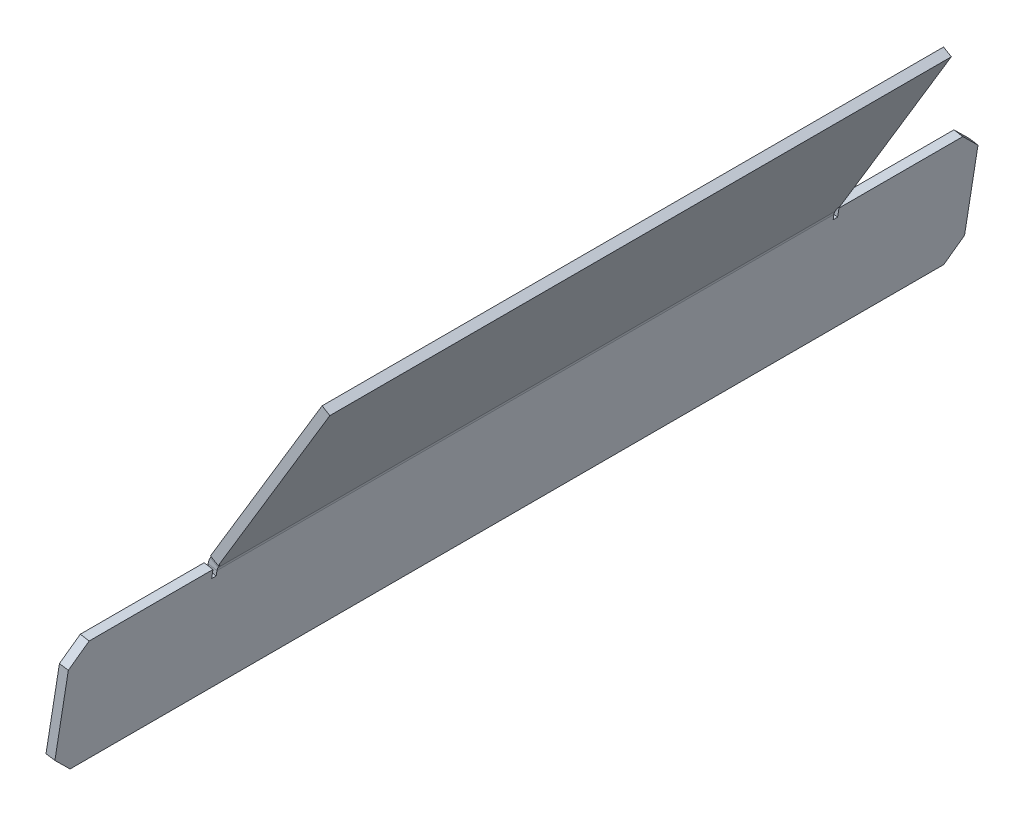
ISO-10303-21;
HEADER;
FILE_DESCRIPTION(('STEP AP214'),'2;1');
FILE_NAME('part.step','',(''),(''),'','','');
FILE_SCHEMA(('AUTOMOTIVE_DESIGN { 1 0 10303 214 1 1 1 1 }'));
ENDSEC;
DATA;
#1=APPLICATION_CONTEXT('core data for automotive mechanical design processes');
#2=APPLICATION_PROTOCOL_DEFINITION('international standard','automotive_design',2000,#1);
#3=PRODUCT_CONTEXT('',#1,'mechanical');
#4=PRODUCT('Part','Part','',(#3));
#5=PRODUCT_RELATED_PRODUCT_CATEGORY('part','',(#4));
#6=PRODUCT_DEFINITION_FORMATION('','',#4);
#7=PRODUCT_DEFINITION_CONTEXT('part definition',#1,'design');
#8=PRODUCT_DEFINITION('design','',#6,#7);
#9=PRODUCT_DEFINITION_SHAPE('','',#8);
#10=(LENGTH_UNIT() NAMED_UNIT(*) SI_UNIT(.MILLI.,.METRE.));
#11=(NAMED_UNIT(*) PLANE_ANGLE_UNIT() SI_UNIT($,.RADIAN.));
#12=(NAMED_UNIT(*) SI_UNIT($,.STERADIAN.) SOLID_ANGLE_UNIT());
#13=UNCERTAINTY_MEASURE_WITH_UNIT(LENGTH_MEASURE(1.E-05),#10,'distance_accuracy_value','');
#14=(GEOMETRIC_REPRESENTATION_CONTEXT(3) GLOBAL_UNCERTAINTY_ASSIGNED_CONTEXT((#13)) GLOBAL_UNIT_ASSIGNED_CONTEXT((#10,
#11,#12)) REPRESENTATION_CONTEXT('',''));
#15=CARTESIAN_POINT('',(0.,0.,0.));
#16=DIRECTION('',(0.,0.,1.));
#17=DIRECTION('',(1.,0.,0.));
#18=AXIS2_PLACEMENT_3D('',#15,#16,#17);
#19=CARTESIAN_POINT('',(643.884672042635,752.187115289054,108.74375));
#20=DIRECTION('',(0.,0.,-1.));
#21=DIRECTION('',(-0.515038074910061,-0.857167300702109,0.));
#22=AXIS2_PLACEMENT_3D('',#19,#20,#21);
#23=PLANE('',#22);
#24=DIRECTION('',(-0.857167300702108,0.515038074910061,0.));
#25=VECTOR('',#24,1.);
#26=CARTESIAN_POINT('',(644.520391245024,753.245129714126,108.74375));
#27=LINE('',#26,#25);
#28=CARTESIAN_POINT('',(647.241897424753,751.609883826287,108.74375));
#29=VERTEX_POINT('',#28);
#30=CARTESIAN_POINT('',(644.520391245024,753.245129714126,108.74375));
#31=VERTEX_POINT('',#30);
#32=EDGE_CURVE('E11',#29,#31,#27,.T.);
#33=ORIENTED_EDGE('',*,*,#32,.F.);
#34=DIRECTION('',(-0.515038074910061,-0.857167300702109,0.));
#35=VECTOR('',#34,1.);
#36=CARTESIAN_POINT('',(646.606178222364,750.551869401215,108.74375));
#37=LINE('',#36,#35);
#38=CARTESIAN_POINT('',(648.059520368673,752.970636916151,108.74375));
#39=VERTEX_POINT('',#38);
#40=EDGE_CURVE('E219',#39,#29,#37,.T.);
#41=ORIENTED_EDGE('',*,*,#40,.F.);
#42=DIRECTION('',(-0.857167300702108,0.515038074910061,0.));
#43=VECTOR('',#42,1.);
#44=CARTESIAN_POINT('',(645.338014188943,754.605882803991,108.74375));
#45=LINE('',#44,#43);
#46=CARTESIAN_POINT('',(645.338014188943,754.605882803991,108.74375));
#47=VERTEX_POINT('',#46);
#48=EDGE_CURVE('E49',#39,#47,#45,.T.);
#49=ORIENTED_EDGE('',*,*,#48,.T.);
#50=DIRECTION('',(-0.515038074910061,-0.857167300702109,0.));
#51=VECTOR('',#50,1.);
#52=CARTESIAN_POINT('',(643.884672042635,752.187115289054,108.74375));
#53=LINE('',#52,#51);
#54=EDGE_CURVE('E298',#47,#31,#53,.T.);
#55=ORIENTED_EDGE('',*,*,#54,.T.);
#56=EDGE_LOOP('',(#33,#41,#49,#55));
#57=FACE_BOUND('',#56,.T.);
#58=ADVANCED_FACE('F39',(#57),#23,.F.);
#59=CARTESIAN_POINT('',(645.338014188943,754.605882803991,-109.5375));
#60=DIRECTION('',(0.515038074910061,0.857167300702109,0.));
#61=DIRECTION('',(0.,0.,-1.));
#62=AXIS2_PLACEMENT_3D('',#59,#60,#61);
#63=PLANE('',#62);
#64=ORIENTED_EDGE('',*,*,#48,.F.);
#65=DIRECTION('',(0.,0.,1.));
#66=VECTOR('',#65,1.);
#67=CARTESIAN_POINT('',(648.059520368673,752.970636916151,-109.5375));
#68=LINE('',#67,#66);
#69=CARTESIAN_POINT('',(648.059520368673,752.970636916151,109.5375));
#70=VERTEX_POINT('',#69);
#71=EDGE_CURVE('E179',#70,#39,#68,.F.);
#72=ORIENTED_EDGE('',*,*,#71,.F.);
#73=DIRECTION('',(-0.857167300702108,0.515038074910061,0.));
#74=VECTOR('',#73,1.);
#75=CARTESIAN_POINT('',(645.338014188943,754.605882803991,109.5375));
#76=LINE('',#75,#74);
#77=CARTESIAN_POINT('',(645.338014188943,754.605882803991,109.5375));
#78=VERTEX_POINT('',#77);
#79=EDGE_CURVE('E292',#70,#78,#76,.T.);
#80=ORIENTED_EDGE('',*,*,#79,.T.);
#81=DIRECTION('',(0.,0.,-1.));
#82=VECTOR('',#81,1.);
#83=CARTESIAN_POINT('',(645.338014188943,754.605882803991,-109.5375));
#84=LINE('',#83,#82);
#85=EDGE_CURVE('E311',#78,#47,#84,.T.);
#86=ORIENTED_EDGE('',*,*,#85,.T.);
#87=EDGE_LOOP('',(#64,#72,#80,#86));
#88=FACE_BOUND('',#87,.T.);
#89=ADVANCED_FACE('F317',(#88),#63,.F.);
#90=CARTESIAN_POINT('',(643.884672042635,752.187115289054,109.5375));
#91=DIRECTION('',(0.,0.,-1.));
#92=DIRECTION('',(-0.515038074910061,-0.857167300702108,0.));
#93=AXIS2_PLACEMENT_3D('',#90,#91,#92);
#94=PLANE('',#93);
#95=ORIENTED_EDGE('',*,*,#79,.F.);
#96=DIRECTION('',(-0.515038074910061,-0.857167300702109,0.));
#97=VECTOR('',#96,1.);
#98=CARTESIAN_POINT('',(646.606178222364,750.551869401215,109.5375));
#99=LINE('',#98,#97);
#100=CARTESIAN_POINT('',(687.413907929238,818.46733667367,109.5375));
#101=VERTEX_POINT('',#100);
#102=EDGE_CURVE('E221',#101,#70,#99,.T.);
#103=ORIENTED_EDGE('',*,*,#102,.F.);
#104=DIRECTION('',(-0.857167300702108,0.515038074910061,0.));
#105=VECTOR('',#104,1.);
#106=CARTESIAN_POINT('',(684.692401749509,820.102582561509,109.5375));
#107=LINE('',#106,#105);
#108=CARTESIAN_POINT('',(684.692401749509,820.102582561509,109.5375));
#109=VERTEX_POINT('',#108);
#110=EDGE_CURVE('E289',#101,#109,#107,.T.);
#111=ORIENTED_EDGE('',*,*,#110,.T.);
#112=DIRECTION('',(-0.515038074910061,-0.857167300702108,0.));
#113=VECTOR('',#112,1.);
#114=CARTESIAN_POINT('',(643.884672042635,752.187115289054,109.5375));
#115=LINE('',#114,#113);
#116=EDGE_CURVE('E334',#109,#78,#115,.T.);
#117=ORIENTED_EDGE('',*,*,#116,.T.);
#118=EDGE_LOOP('',(#95,#103,#111,#117));
#119=FACE_BOUND('',#118,.T.);
#120=ADVANCED_FACE('F430',(#119),#94,.F.);
#121=CARTESIAN_POINT('',(684.692401749509,820.102582561509,-109.5375));
#122=DIRECTION('',(-0.515038074910061,-0.857167300702109,0.));
#123=DIRECTION('',(0.,0.,1.));
#124=AXIS2_PLACEMENT_3D('',#121,#122,#123);
#125=PLANE('',#124);
#126=ORIENTED_EDGE('',*,*,#110,.F.);
#127=DIRECTION('',(0.,0.,1.));
#128=VECTOR('',#127,1.);
#129=CARTESIAN_POINT('',(687.413907929238,818.46733667367,-109.5375));
#130=LINE('',#129,#128);
#131=CARTESIAN_POINT('',(687.413907929238,818.46733667367,-109.5375));
#132=VERTEX_POINT('',#131);
#133=EDGE_CURVE('E228',#132,#101,#130,.T.);
#134=ORIENTED_EDGE('',*,*,#133,.F.);
#135=DIRECTION('',(-0.857167300702108,0.515038074910061,0.));
#136=VECTOR('',#135,1.);
#137=CARTESIAN_POINT('',(684.692401749509,820.102582561509,-109.5375));
#138=LINE('',#137,#136);
#139=CARTESIAN_POINT('',(684.692401749509,820.102582561509,-109.5375));
#140=VERTEX_POINT('',#139);
#141=EDGE_CURVE('E286',#132,#140,#138,.T.);
#142=ORIENTED_EDGE('',*,*,#141,.T.);
#143=DIRECTION('',(0.,0.,1.));
#144=VECTOR('',#143,1.);
#145=CARTESIAN_POINT('',(684.692401749509,820.102582561509,-109.5375));
#146=LINE('',#145,#144);
#147=EDGE_CURVE('E337',#140,#109,#146,.T.);
#148=ORIENTED_EDGE('',*,*,#147,.T.);
#149=EDGE_LOOP('',(#126,#134,#142,#148));
#150=FACE_BOUND('',#149,.T.);
#151=ADVANCED_FACE('F435',(#150),#125,.F.);
#152=CARTESIAN_POINT('',(643.884672042635,752.187115289054,-109.5375));
#153=DIRECTION('',(0.,0.,-1.));
#154=DIRECTION('',(-0.515038074910061,-0.857167300702108,0.));
#155=AXIS2_PLACEMENT_3D('',#152,#153,#154);
#156=PLANE('',#155);
#157=ORIENTED_EDGE('',*,*,#141,.F.);
#158=DIRECTION('',(-0.515038074910061,-0.857167300702109,0.));
#159=VECTOR('',#158,1.);
#160=CARTESIAN_POINT('',(646.606178222364,750.551869401215,-109.5375));
#161=LINE('',#160,#159);
#162=CARTESIAN_POINT('',(648.059520368673,752.970636916151,-109.5375));
#163=VERTEX_POINT('',#162);
#164=EDGE_CURVE('E199',#132,#163,#161,.T.);
#165=ORIENTED_EDGE('',*,*,#164,.T.);
#166=DIRECTION('',(-0.857167300702108,0.515038074910061,0.));
#167=VECTOR('',#166,1.);
#168=CARTESIAN_POINT('',(645.338014188943,754.605882803991,-109.5375));
#169=LINE('',#168,#167);
#170=CARTESIAN_POINT('',(645.338014188943,754.605882803991,-109.5375));
#171=VERTEX_POINT('',#170);
#172=EDGE_CURVE('E283',#163,#171,#169,.T.);
#173=ORIENTED_EDGE('',*,*,#172,.T.);
#174=DIRECTION('',(-0.515038074910061,-0.857167300702108,0.));
#175=VECTOR('',#174,1.);
#176=CARTESIAN_POINT('',(643.884672042635,752.187115289054,-109.5375));
#177=LINE('',#176,#175);
#178=EDGE_CURVE('E341',#140,#171,#177,.T.);
#179=ORIENTED_EDGE('',*,*,#178,.F.);
#180=EDGE_LOOP('',(#157,#165,#173,#179));
#181=FACE_BOUND('',#180,.T.);
#182=ADVANCED_FACE('F438',(#181),#156,.T.);
#183=CARTESIAN_POINT('',(645.338014188943,754.605882803991,-109.5375));
#184=DIRECTION('',(0.515038074910061,0.857167300702109,0.));
#185=DIRECTION('',(0.,0.,-1.));
#186=AXIS2_PLACEMENT_3D('',#183,#184,#185);
#187=PLANE('',#186);
#188=ORIENTED_EDGE('',*,*,#172,.F.);
#189=DIRECTION('',(0.,0.,1.));
#190=VECTOR('',#189,1.);
#191=CARTESIAN_POINT('',(648.059520368673,752.970636916151,-109.5375));
#192=LINE('',#191,#190);
#193=CARTESIAN_POINT('',(648.059520368673,752.970636916151,-108.74375));
#194=VERTEX_POINT('',#193);
#195=EDGE_CURVE('E203',#194,#163,#192,.F.);
#196=ORIENTED_EDGE('',*,*,#195,.F.);
#197=DIRECTION('',(-0.857167300702108,0.515038074910061,0.));
#198=VECTOR('',#197,1.);
#199=CARTESIAN_POINT('',(645.338014188943,754.605882803991,-108.74375));
#200=LINE('',#199,#198);
#201=CARTESIAN_POINT('',(645.338014188943,754.605882803991,-108.74375));
#202=VERTEX_POINT('',#201);
#203=EDGE_CURVE('E280',#194,#202,#200,.T.);
#204=ORIENTED_EDGE('',*,*,#203,.T.);
#205=DIRECTION('',(0.,0.,-1.));
#206=VECTOR('',#205,1.);
#207=CARTESIAN_POINT('',(645.338014188943,754.605882803991,-109.5375));
#208=LINE('',#207,#206);
#209=EDGE_CURVE('E373',#202,#171,#208,.T.);
#210=ORIENTED_EDGE('',*,*,#209,.T.);
#211=EDGE_LOOP('',(#188,#196,#204,#210));
#212=FACE_BOUND('',#211,.T.);
#213=ADVANCED_FACE('F444',(#212),#187,.F.);
#214=CARTESIAN_POINT('',(643.884672042635,752.187115289054,-108.74375));
#215=DIRECTION('',(0.,0.,1.));
#216=DIRECTION('',(0.515038074910061,0.857167300702109,0.));
#217=AXIS2_PLACEMENT_3D('',#214,#215,#216);
#218=PLANE('',#217);
#219=ORIENTED_EDGE('',*,*,#203,.F.);
#220=DIRECTION('',(-0.515038074910061,-0.857167300702109,0.));
#221=VECTOR('',#220,1.);
#222=CARTESIAN_POINT('',(646.606178222364,750.551869401215,-108.74375));
#223=LINE('',#222,#221);
#224=CARTESIAN_POINT('',(647.241897424753,751.609883826287,-108.74375));
#225=VERTEX_POINT('',#224);
#226=EDGE_CURVE('E217',#225,#194,#223,.F.);
#227=ORIENTED_EDGE('',*,*,#226,.F.);
#228=DIRECTION('',(-0.857167300702113,0.515038074910052,0.));
#229=VECTOR('',#228,1.);
#230=CARTESIAN_POINT('',(644.520391245024,753.245129714126,-108.74375));
#231=LINE('',#230,#229);
#232=CARTESIAN_POINT('',(644.520391245024,753.245129714126,-108.74375));
#233=VERTEX_POINT('',#232);
#234=EDGE_CURVE('E277',#225,#233,#231,.T.);
#235=ORIENTED_EDGE('',*,*,#234,.T.);
#236=DIRECTION('',(0.515038074910061,0.857167300702109,0.));
#237=VECTOR('',#236,1.);
#238=CARTESIAN_POINT('',(643.884672042635,752.187115289054,-108.74375));
#239=LINE('',#238,#237);
#240=EDGE_CURVE('E376',#233,#202,#239,.T.);
#241=ORIENTED_EDGE('',*,*,#240,.T.);
#242=EDGE_LOOP('',(#219,#227,#235,#241));
#243=FACE_BOUND('',#242,.T.);
#244=ADVANCED_FACE('F447',(#243),#218,.F.);
#245=CARTESIAN_POINT('',(649.963403604482,749.974637938447,-108.74375));
#246=DIRECTION('',(0.,0.,1.));
#247=DIRECTION('',(1.,0.,0.));
#248=AXIS2_PLACEMENT_3D('',#245,#246,#247);
#249=PLANE('',#248);
#250=ORIENTED_EDGE('',*,*,#234,.F.);
#251=CARTESIAN_POINT('',(649.963403604482,749.974637938447,-108.74375));
#252=DIRECTION('',(0.,0.,1.));
#253=DIRECTION('',(1.,0.,0.));
#254=AXIS2_PLACEMENT_3D('',#251,#252,#253);
#255=CIRCLE('',#254,3.175);
#256=CARTESIAN_POINT('',(646.827493123093,750.47131736495,-108.74375));
#257=VERTEX_POINT('',#256);
#258=EDGE_CURVE('E170',#225,#257,#255,.T.);
#259=ORIENTED_EDGE('',*,*,#258,.T.);
#260=DIRECTION('',(-0.987688340595137,0.156434465040237,0.));
#261=VECTOR('',#260,1.);
#262=CARTESIAN_POINT('',(643.691582641703,750.967996791453,-108.74375));
#263=LINE('',#262,#261);
#264=CARTESIAN_POINT('',(643.691582641703,750.967996791453,-108.74375));
#265=VERTEX_POINT('',#264);
#266=EDGE_CURVE('E57',#257,#265,#263,.T.);
#267=ORIENTED_EDGE('',*,*,#266,.T.);
#268=CARTESIAN_POINT('',(649.963403604482,749.974637938447,-108.74375));
#269=DIRECTION('',(0.,0.,-1.));
#270=DIRECTION('',(-1.,0.,0.));
#271=AXIS2_PLACEMENT_3D('',#268,#269,#270);
#272=CIRCLE('',#271,6.35);
#273=EDGE_CURVE('E333',#233,#265,#272,.F.);
#274=ORIENTED_EDGE('',*,*,#273,.F.);
#275=EDGE_LOOP('',(#250,#259,#267,#274));
#276=FACE_BOUND('',#275,.T.);
#277=ADVANCED_FACE('F448',(#276),#249,.F.);
#278=CARTESIAN_POINT('',(637.161453578378,709.738384526862,-108.74375));
#279=DIRECTION('',(0.,0.,1.));
#280=DIRECTION('',(0.156434465040237,0.987688340595137,0.));
#281=AXIS2_PLACEMENT_3D('',#278,#279,#280);
#282=PLANE('',#281);
#283=ORIENTED_EDGE('',*,*,#266,.F.);
#284=DIRECTION('',(-0.156434465040237,-0.987688340595137,0.));
#285=VECTOR('',#284,1.);
#286=CARTESIAN_POINT('',(640.297364059767,709.241705100359,-108.74375));
#287=LINE('',#286,#285);
#288=CARTESIAN_POINT('',(646.544485887948,748.684480005395,-108.74375));
#289=VERTEX_POINT('',#288);
#290=EDGE_CURVE('E162',#289,#257,#287,.F.);
#291=ORIENTED_EDGE('',*,*,#290,.F.);
#292=DIRECTION('',(-0.987688340595137,0.156434465040237,0.));
#293=VECTOR('',#292,1.);
#294=CARTESIAN_POINT('',(643.408575406559,749.181159431898,-108.74375));
#295=LINE('',#294,#293);
#296=CARTESIAN_POINT('',(643.408575406559,749.181159431898,-108.74375));
#297=VERTEX_POINT('',#296);
#298=EDGE_CURVE('E273',#289,#297,#295,.T.);
#299=ORIENTED_EDGE('',*,*,#298,.T.);
#300=DIRECTION('',(0.156434465040237,0.987688340595137,0.));
#301=VECTOR('',#300,1.);
#302=CARTESIAN_POINT('',(637.161453578378,709.738384526862,-108.74375));
#303=LINE('',#302,#301);
#304=EDGE_CURVE('E315',#297,#265,#303,.T.);
#305=ORIENTED_EDGE('',*,*,#304,.T.);
#306=EDGE_LOOP('',(#283,#291,#299,#305));
#307=FACE_BOUND('',#306,.T.);
#308=ADVANCED_FACE('F386',(#307),#282,.F.);
#309=CARTESIAN_POINT('',(643.408575406559,749.181159431898,-109.5375));
#310=DIRECTION('',(-0.156434465040237,-0.987688340595137,0.));
#311=DIRECTION('',(0.,0.,1.));
#312=AXIS2_PLACEMENT_3D('',#309,#310,#311);
#313=PLANE('',#312);
#314=ORIENTED_EDGE('',*,*,#298,.F.);
#315=DIRECTION('',(0.,0.,1.));
#316=VECTOR('',#315,1.);
#317=CARTESIAN_POINT('',(646.544485887948,748.684480005395,-109.5375));
#318=LINE('',#317,#316);
#319=CARTESIAN_POINT('',(646.544485887948,748.684480005395,-110.33125));
#320=VERTEX_POINT('',#319);
#321=EDGE_CURVE('E215',#320,#289,#318,.T.);
#322=ORIENTED_EDGE('',*,*,#321,.F.);
#323=DIRECTION('',(-0.987688340595137,0.156434465040237,0.));
#324=VECTOR('',#323,1.);
#325=CARTESIAN_POINT('',(643.408575406559,749.181159431898,-110.33125));
#326=LINE('',#325,#324);
#327=CARTESIAN_POINT('',(643.408575406559,749.181159431898,-110.33125));
#328=VERTEX_POINT('',#327);
#329=EDGE_CURVE('E270',#320,#328,#326,.T.);
#330=ORIENTED_EDGE('',*,*,#329,.T.);
#331=DIRECTION('',(0.,0.,1.));
#332=VECTOR('',#331,1.);
#333=CARTESIAN_POINT('',(643.408575406559,749.181159431898,-109.5375));
#334=LINE('',#333,#332);
#335=EDGE_CURVE('E379',#328,#297,#334,.T.);
#336=ORIENTED_EDGE('',*,*,#335,.T.);
#337=EDGE_LOOP('',(#314,#322,#330,#336));
#338=FACE_BOUND('',#337,.T.);
#339=ADVANCED_FACE('F455',(#338),#313,.F.);
#340=CARTESIAN_POINT('',(637.161453578378,709.738384526862,-110.33125));
#341=DIRECTION('',(0.,0.,-1.));
#342=DIRECTION('',(-0.156434465040237,-0.987688340595137,0.));
#343=AXIS2_PLACEMENT_3D('',#340,#341,#342);
#344=PLANE('',#343);
#345=ORIENTED_EDGE('',*,*,#329,.F.);
#346=DIRECTION('',(-0.156434465040237,-0.987688340595137,0.));
#347=VECTOR('',#346,1.);
#348=CARTESIAN_POINT('',(640.297364059767,709.241705100359,-110.33125));
#349=LINE('',#348,#347);
#350=CARTESIAN_POINT('',(647.020582524024,751.690435862551,-110.33125));
#351=VERTEX_POINT('',#350);
#352=EDGE_CURVE('E212',#351,#320,#349,.T.);
#353=ORIENTED_EDGE('',*,*,#352,.F.);
#354=DIRECTION('',(-0.987688340595137,0.156434465040237,0.));
#355=VECTOR('',#354,1.);
#356=CARTESIAN_POINT('',(643.88467204262,752.187115289057,-110.33125));
#357=LINE('',#356,#355);
#358=CARTESIAN_POINT('',(643.88467204262,752.187115289057,-110.33125));
#359=VERTEX_POINT('',#358);
#360=EDGE_CURVE('E267',#351,#359,#357,.T.);
#361=ORIENTED_EDGE('',*,*,#360,.T.);
#362=DIRECTION('',(-0.156434465040237,-0.987688340595137,0.));
#363=VECTOR('',#362,1.);
#364=CARTESIAN_POINT('',(637.161453578378,709.738384526862,-110.33125));
#365=LINE('',#364,#363);
#366=EDGE_CURVE('E382',#359,#328,#365,.T.);
#367=ORIENTED_EDGE('',*,*,#366,.T.);
#368=EDGE_LOOP('',(#345,#353,#361,#367));
#369=FACE_BOUND('',#368,.T.);
#370=ADVANCED_FACE('F504',(#369),#344,.F.);
#371=CARTESIAN_POINT('',(643.88467204262,752.187115289057,-109.5375));
#372=DIRECTION('',(0.156434465040237,0.987688340595137,0.));
#373=DIRECTION('',(0.,0.,-1.));
#374=AXIS2_PLACEMENT_3D('',#371,#372,#373);
#375=PLANE('',#374);
#376=ORIENTED_EDGE('',*,*,#360,.F.);
#377=DIRECTION('',(0.,0.,1.));
#378=VECTOR('',#377,1.);
#379=CARTESIAN_POINT('',(647.020582524024,751.690435862551,-109.5375));
#380=LINE('',#379,#378);
#381=CARTESIAN_POINT('',(647.020582524024,751.690435862551,-153.987500000025));
#382=VERTEX_POINT('',#381);
#383=EDGE_CURVE('E186',#351,#382,#380,.F.);
#384=ORIENTED_EDGE('',*,*,#383,.T.);
#385=DIRECTION('',(-0.987688340595137,0.156434465040237,0.));
#386=VECTOR('',#385,1.);
#387=CARTESIAN_POINT('',(643.88467204262,752.187115289057,-153.987500000025));
#388=LINE('',#387,#386);
#389=CARTESIAN_POINT('',(643.88467204262,752.187115289057,-153.987500000025));
#390=VERTEX_POINT('',#389);
#391=EDGE_CURVE('E264',#382,#390,#388,.T.);
#392=ORIENTED_EDGE('',*,*,#391,.T.);
#393=DIRECTION('',(0.,0.,-1.));
#394=VECTOR('',#393,1.);
#395=CARTESIAN_POINT('',(643.88467204262,752.187115289057,-109.5375));
#396=LINE('',#395,#394);
#397=EDGE_CURVE('E361',#359,#390,#396,.T.);
#398=ORIENTED_EDGE('',*,*,#397,.F.);
#399=EDGE_LOOP('',(#376,#384,#392,#398));
#400=FACE_BOUND('',#399,.T.);
#401=ADVANCED_FACE('F516',(#400),#375,.T.);
#402=CARTESIAN_POINT('',(643.999818796028,752.914123277697,-153.251429765355));
#403=DIRECTION('',(-0.110615871041241,-0.698401123333705,0.707106781186552));
#404=DIRECTION('',(0.110615871041242,0.698401123333714,0.707106781186543));
#405=AXIS2_PLACEMENT_3D('',#402,#403,#404);
#406=PLANE('',#405);
#407=ORIENTED_EDGE('',*,*,#391,.F.);
#408=DIRECTION('',(0.110615871041242,0.698401123333714,0.707106781186543));
#409=VECTOR('',#408,1.);
#410=CARTESIAN_POINT('',(647.135729277417,752.417443851194,-153.251429765355));
#411=LINE('',#410,#409);
#412=CARTESIAN_POINT('',(646.027223671019,745.418614899772,-160.337500000024));
#413=VERTEX_POINT('',#412);
#414=EDGE_CURVE('E207',#382,#413,#411,.F.);
#415=ORIENTED_EDGE('',*,*,#414,.T.);
#416=DIRECTION('',(-0.987688340595137,0.156434465040237,0.));
#417=VECTOR('',#416,1.);
#418=CARTESIAN_POINT('',(642.891313189614,745.915294326278,-160.337500000024));
#419=LINE('',#418,#417);
#420=CARTESIAN_POINT('',(642.891313189614,745.915294326278,-160.337500000024));
#421=VERTEX_POINT('',#420);
#422=EDGE_CURVE('E261',#413,#421,#419,.T.);
#423=ORIENTED_EDGE('',*,*,#422,.T.);
#424=DIRECTION('',(0.110615871041242,0.698401123333714,0.707106781186543));
#425=VECTOR('',#424,1.);
#426=CARTESIAN_POINT('',(643.999818796028,752.914123277697,-153.251429765355));
#427=LINE('',#426,#425);
#428=EDGE_CURVE('E364',#390,#421,#427,.F.);
#429=ORIENTED_EDGE('',*,*,#428,.F.);
#430=EDGE_LOOP('',(#407,#415,#423,#429));
#431=FACE_BOUND('',#430,.T.);
#432=ADVANCED_FACE('F528',(#431),#406,.F.);
#433=CARTESIAN_POINT('',(637.161453578363,709.738384526864,-160.337500000024));
#434=DIRECTION('',(0.,0.,-1.));
#435=DIRECTION('',(-0.156434465040219,-0.98768834059514,0.));
#436=AXIS2_PLACEMENT_3D('',#433,#434,#435);
#437=PLANE('',#436);
#438=ORIENTED_EDGE('',*,*,#422,.F.);
#439=DIRECTION('',(-0.156434465040237,-0.987688340595137,0.));
#440=VECTOR('',#439,1.);
#441=CARTESIAN_POINT('',(640.297364059767,709.241705100359,-160.337500000024));
#442=LINE('',#441,#440);
#443=CARTESIAN_POINT('',(641.290722912773,715.513526063138,-160.337500000024));
#444=VERTEX_POINT('',#443);
#445=EDGE_CURVE('E204',#413,#444,#442,.T.);
#446=ORIENTED_EDGE('',*,*,#445,.T.);
#447=DIRECTION('',(-0.987688340595137,0.156434465040237,0.));
#448=VECTOR('',#447,1.);
#449=CARTESIAN_POINT('',(638.154812431369,716.010205489643,-160.337500000024));
#450=LINE('',#449,#448);
#451=CARTESIAN_POINT('',(638.154812431369,716.010205489643,-160.337500000024));
#452=VERTEX_POINT('',#451);
#453=EDGE_CURVE('E258',#444,#452,#450,.T.);
#454=ORIENTED_EDGE('',*,*,#453,.T.);
#455=DIRECTION('',(-0.156434465040219,-0.98768834059514,0.));
#456=VECTOR('',#455,1.);
#457=CARTESIAN_POINT('',(637.161453578363,709.738384526864,-160.337500000024));
#458=LINE('',#457,#456);
#459=EDGE_CURVE('E367',#421,#452,#458,.T.);
#460=ORIENTED_EDGE('',*,*,#459,.F.);
#461=EDGE_LOOP('',(#438,#446,#454,#460));
#462=FACE_BOUND('',#461,.T.);
#463=ADVANCED_FACE('F540',(#462),#437,.T.);
#464=CARTESIAN_POINT('',(633.684697592857,687.787011157123,-131.762500000012));
#465=DIRECTION('',(0.110615871041241,0.698401123333708,0.707106781186549));
#466=DIRECTION('',(0.110615871041242,0.698401123333711,-0.707106781186546));
#467=AXIS2_PLACEMENT_3D('',#464,#465,#466);
#468=PLANE('',#467);
#469=ORIENTED_EDGE('',*,*,#453,.F.);
#470=DIRECTION('',(0.110615871041242,0.698401123333711,-0.707106781186546));
#471=VECTOR('',#470,1.);
#472=CARTESIAN_POINT('',(636.820608074246,687.29033173062,-131.762500000012));
#473=LINE('',#472,#471);
#474=CARTESIAN_POINT('',(640.297364059767,709.241705100359,-153.987500000024));
#475=VERTEX_POINT('',#474);
#476=EDGE_CURVE('E200',#444,#475,#473,.F.);
#477=ORIENTED_EDGE('',*,*,#476,.T.);
#478=DIRECTION('',(-0.987688340595137,0.156434465040237,0.));
#479=VECTOR('',#478,1.);
#480=CARTESIAN_POINT('',(637.161453578378,709.738384526862,-153.987500000024));
#481=LINE('',#480,#479);
#482=CARTESIAN_POINT('',(637.161453578378,709.738384526862,-153.987500000024));
#483=VERTEX_POINT('',#482);
#484=EDGE_CURVE('E255',#475,#483,#481,.T.);
#485=ORIENTED_EDGE('',*,*,#484,.T.);
#486=DIRECTION('',(0.110615871041242,0.698401123333711,-0.707106781186546));
#487=VECTOR('',#486,1.);
#488=CARTESIAN_POINT('',(633.684697592857,687.787011157123,-131.762500000012));
#489=LINE('',#488,#487);
#490=EDGE_CURVE('E370',#452,#483,#489,.F.);
#491=ORIENTED_EDGE('',*,*,#490,.F.);
#492=EDGE_LOOP('',(#469,#477,#485,#491));
#493=FACE_BOUND('',#492,.T.);
#494=ADVANCED_FACE('F552',(#493),#468,.F.);
#495=CARTESIAN_POINT('',(637.161453578378,709.738384526862,-109.5375));
#496=DIRECTION('',(-0.156434465040237,-0.987688340595137,0.));
#497=DIRECTION('',(0.,0.,1.));
#498=AXIS2_PLACEMENT_3D('',#495,#496,#497);
#499=PLANE('',#498);
#500=ORIENTED_EDGE('',*,*,#484,.F.);
#501=DIRECTION('',(0.,0.,1.));
#502=VECTOR('',#501,1.);
#503=CARTESIAN_POINT('',(640.297364059767,709.241705100359,-109.5375));
#504=LINE('',#503,#502);
#505=CARTESIAN_POINT('',(640.297364059767,709.241705100359,153.987500000024));
#506=VERTEX_POINT('',#505);
#507=EDGE_CURVE('E196',#475,#506,#504,.T.);
#508=ORIENTED_EDGE('',*,*,#507,.T.);
#509=DIRECTION('',(-0.987688340595137,0.156434465040237,0.));
#510=VECTOR('',#509,1.);
#511=CARTESIAN_POINT('',(637.161453578378,709.738384526862,153.987500000024));
#512=LINE('',#511,#510);
#513=CARTESIAN_POINT('',(637.161453578378,709.738384526862,153.987500000024));
#514=VERTEX_POINT('',#513);
#515=EDGE_CURVE('E252',#506,#514,#512,.T.);
#516=ORIENTED_EDGE('',*,*,#515,.T.);
#517=DIRECTION('',(0.,0.,1.));
#518=VECTOR('',#517,1.);
#519=CARTESIAN_POINT('',(637.161453578378,709.738384526862,-109.5375));
#520=LINE('',#519,#518);
#521=EDGE_CURVE('E346',#483,#514,#520,.T.);
#522=ORIENTED_EDGE('',*,*,#521,.F.);
#523=EDGE_LOOP('',(#500,#508,#516,#522));
#524=FACE_BOUND('',#523,.T.);
#525=ADVANCED_FACE('F564',(#524),#499,.T.);
#526=CARTESIAN_POINT('',(616.549257378512,579.598099549183,22.2250000000134));
#527=DIRECTION('',(0.110615871041241,0.698401123333706,-0.707106781186551));
#528=DIRECTION('',(-0.110615871041242,-0.698401123333713,-0.707106781186544));
#529=AXIS2_PLACEMENT_3D('',#526,#527,#528);
#530=PLANE('',#529);
#531=ORIENTED_EDGE('',*,*,#515,.F.);
#532=DIRECTION('',(-0.110615871041242,-0.698401123333713,-0.707106781186544));
#533=VECTOR('',#532,1.);
#534=CARTESIAN_POINT('',(619.685167859901,579.10142012268,22.2250000000134));
#535=LINE('',#534,#533);
#536=CARTESIAN_POINT('',(641.290722912773,715.513526063138,160.337500000025));
#537=VERTEX_POINT('',#536);
#538=EDGE_CURVE('E193',#506,#537,#535,.F.);
#539=ORIENTED_EDGE('',*,*,#538,.T.);
#540=DIRECTION('',(-0.987688340595137,0.156434465040237,0.));
#541=VECTOR('',#540,1.);
#542=CARTESIAN_POINT('',(638.154812431369,716.010205489643,160.337500000024));
#543=LINE('',#542,#541);
#544=CARTESIAN_POINT('',(638.154812431369,716.010205489643,160.337500000024));
#545=VERTEX_POINT('',#544);
#546=EDGE_CURVE('E249',#537,#545,#543,.T.);
#547=ORIENTED_EDGE('',*,*,#546,.T.);
#548=DIRECTION('',(-0.110615871041242,-0.698401123333713,-0.707106781186544));
#549=VECTOR('',#548,1.);
#550=CARTESIAN_POINT('',(616.549257378512,579.598099549183,22.2250000000134));
#551=LINE('',#550,#549);
#552=EDGE_CURVE('E349',#514,#545,#551,.F.);
#553=ORIENTED_EDGE('',*,*,#552,.F.);
#554=EDGE_LOOP('',(#531,#539,#547,#553));
#555=FACE_BOUND('',#554,.T.);
#556=ADVANCED_FACE('F576',(#555),#530,.F.);
#557=CARTESIAN_POINT('',(637.161453578363,709.738384526864,160.337500000024));
#558=DIRECTION('',(0.,0.,1.));
#559=DIRECTION('',(0.156434465040219,0.98768834059514,0.));
#560=AXIS2_PLACEMENT_3D('',#557,#558,#559);
#561=PLANE('',#560);
#562=ORIENTED_EDGE('',*,*,#546,.F.);
#563=DIRECTION('',(-0.156434465040237,-0.987688340595137,0.));
#564=VECTOR('',#563,1.);
#565=CARTESIAN_POINT('',(640.297364059767,709.241705100359,160.337500000025));
#566=LINE('',#565,#564);
#567=CARTESIAN_POINT('',(646.027223671019,745.418614899772,160.337500000025));
#568=VERTEX_POINT('',#567);
#569=EDGE_CURVE('E190',#537,#568,#566,.F.);
#570=ORIENTED_EDGE('',*,*,#569,.T.);
#571=DIRECTION('',(-0.987688340595137,0.156434465040237,0.));
#572=VECTOR('',#571,1.);
#573=CARTESIAN_POINT('',(642.891313189614,745.915294326278,160.337500000024));
#574=LINE('',#573,#572);
#575=CARTESIAN_POINT('',(642.891313189614,745.915294326278,160.337500000024));
#576=VERTEX_POINT('',#575);
#577=EDGE_CURVE('E246',#568,#576,#574,.T.);
#578=ORIENTED_EDGE('',*,*,#577,.T.);
#579=DIRECTION('',(0.156434465040219,0.98768834059514,0.));
#580=VECTOR('',#579,1.);
#581=CARTESIAN_POINT('',(637.161453578363,709.738384526864,160.337500000024));
#582=LINE('',#581,#580);
#583=EDGE_CURVE('E352',#545,#576,#582,.T.);
#584=ORIENTED_EDGE('',*,*,#583,.F.);
#585=EDGE_LOOP('',(#562,#570,#578,#584));
#586=FACE_BOUND('',#585,.T.);
#587=ADVANCED_FACE('F588',(#586),#561,.T.);
#588=CARTESIAN_POINT('',(661.135259010372,861.103034885637,43.7139297653549));
#589=DIRECTION('',(-0.110615871041241,-0.698401123333708,-0.707106781186549));
#590=DIRECTION('',(-0.110615871041242,-0.698401123333711,0.707106781186546));
#591=AXIS2_PLACEMENT_3D('',#588,#589,#590);
#592=PLANE('',#591);
#593=ORIENTED_EDGE('',*,*,#577,.F.);
#594=DIRECTION('',(-0.110615871041242,-0.698401123333711,0.707106781186546));
#595=VECTOR('',#594,1.);
#596=CARTESIAN_POINT('',(664.271169491762,860.606355459134,43.7139297653549));
#597=LINE('',#596,#595);
#598=CARTESIAN_POINT('',(647.020582524024,751.690435862551,153.987500000025));
#599=VERTEX_POINT('',#598);
#600=EDGE_CURVE('E187',#568,#599,#597,.F.);
#601=ORIENTED_EDGE('',*,*,#600,.T.);
#602=DIRECTION('',(-0.987688340595137,0.156434465040237,0.));
#603=VECTOR('',#602,1.);
#604=CARTESIAN_POINT('',(643.88467204262,752.187115289057,153.987500000024));
#605=LINE('',#604,#603);
#606=CARTESIAN_POINT('',(643.88467204262,752.187115289057,153.987500000024));
#607=VERTEX_POINT('',#606);
#608=EDGE_CURVE('E243',#599,#607,#605,.T.);
#609=ORIENTED_EDGE('',*,*,#608,.T.);
#610=DIRECTION('',(-0.110615871041242,-0.698401123333711,0.707106781186546));
#611=VECTOR('',#610,1.);
#612=CARTESIAN_POINT('',(661.135259010372,861.103034885637,43.7139297653549));
#613=LINE('',#612,#611);
#614=EDGE_CURVE('E355',#576,#607,#613,.F.);
#615=ORIENTED_EDGE('',*,*,#614,.F.);
#616=EDGE_LOOP('',(#593,#601,#609,#615));
#617=FACE_BOUND('',#616,.T.);
#618=ADVANCED_FACE('F600',(#617),#592,.F.);
#619=CARTESIAN_POINT('',(643.88467204262,752.187115289057,109.5375));
#620=DIRECTION('',(0.156434465040237,0.987688340595137,0.));
#621=DIRECTION('',(0.,0.,-1.));
#622=AXIS2_PLACEMENT_3D('',#619,#620,#621);
#623=PLANE('',#622);
#624=ORIENTED_EDGE('',*,*,#608,.F.);
#625=DIRECTION('',(0.,0.,1.));
#626=VECTOR('',#625,1.);
#627=CARTESIAN_POINT('',(647.020582524024,751.690435862551,-109.5375));
#628=LINE('',#627,#626);
#629=CARTESIAN_POINT('',(647.020582524024,751.690435862551,110.33125));
#630=VERTEX_POINT('',#629);
#631=EDGE_CURVE('E183',#599,#630,#628,.F.);
#632=ORIENTED_EDGE('',*,*,#631,.T.);
#633=DIRECTION('',(-0.987688340595137,0.156434465040237,0.));
#634=VECTOR('',#633,1.);
#635=CARTESIAN_POINT('',(643.88467204262,752.187115289057,110.33125));
#636=LINE('',#635,#634);
#637=CARTESIAN_POINT('',(643.88467204262,752.187115289057,110.33125));
#638=VERTEX_POINT('',#637);
#639=EDGE_CURVE('E240',#630,#638,#636,.T.);
#640=ORIENTED_EDGE('',*,*,#639,.T.);
#641=DIRECTION('',(0.,0.,-1.));
#642=VECTOR('',#641,1.);
#643=CARTESIAN_POINT('',(643.88467204262,752.187115289057,109.5375));
#644=LINE('',#643,#642);
#645=EDGE_CURVE('E358',#607,#638,#644,.T.);
#646=ORIENTED_EDGE('',*,*,#645,.F.);
#647=EDGE_LOOP('',(#624,#632,#640,#646));
#648=FACE_BOUND('',#647,.T.);
#649=ADVANCED_FACE('F612',(#648),#623,.T.);
#650=CARTESIAN_POINT('',(637.161453578378,709.738384526862,110.33125));
#651=DIRECTION('',(0.,0.,1.));
#652=DIRECTION('',(0.156434465040237,0.987688340595137,0.));
#653=AXIS2_PLACEMENT_3D('',#650,#651,#652);
#654=PLANE('',#653);
#655=ORIENTED_EDGE('',*,*,#639,.F.);
#656=DIRECTION('',(-0.156434465040237,-0.987688340595137,0.));
#657=VECTOR('',#656,1.);
#658=CARTESIAN_POINT('',(640.297364059767,709.241705100359,110.33125));
#659=LINE('',#658,#657);
#660=CARTESIAN_POINT('',(646.544485887948,748.684480005395,110.33125));
#661=VERTEX_POINT('',#660);
#662=EDGE_CURVE('E174',#661,#630,#659,.F.);
#663=ORIENTED_EDGE('',*,*,#662,.F.);
#664=DIRECTION('',(-0.987688340595137,0.156434465040237,0.));
#665=VECTOR('',#664,1.);
#666=CARTESIAN_POINT('',(643.408575406559,749.181159431898,110.33125));
#667=LINE('',#666,#665);
#668=CARTESIAN_POINT('',(643.408575406559,749.181159431898,110.33125));
#669=VERTEX_POINT('',#668);
#670=EDGE_CURVE('E237',#661,#669,#667,.T.);
#671=ORIENTED_EDGE('',*,*,#670,.T.);
#672=DIRECTION('',(0.156434465040237,0.987688340595137,0.));
#673=VECTOR('',#672,1.);
#674=CARTESIAN_POINT('',(637.161453578378,709.738384526862,110.33125));
#675=LINE('',#674,#673);
#676=EDGE_CURVE('E325',#669,#638,#675,.T.);
#677=ORIENTED_EDGE('',*,*,#676,.T.);
#678=EDGE_LOOP('',(#655,#663,#671,#677));
#679=FACE_BOUND('',#678,.T.);
#680=ADVANCED_FACE('F624',(#679),#654,.F.);
#681=CARTESIAN_POINT('',(643.408575406559,749.181159431898,-109.5375));
#682=DIRECTION('',(-0.156434465040237,-0.987688340595137,0.));
#683=DIRECTION('',(0.,0.,1.));
#684=AXIS2_PLACEMENT_3D('',#681,#682,#683);
#685=PLANE('',#684);
#686=ORIENTED_EDGE('',*,*,#670,.F.);
#687=DIRECTION('',(0.,0.,1.));
#688=VECTOR('',#687,1.);
#689=CARTESIAN_POINT('',(646.544485887948,748.684480005395,-109.5375));
#690=LINE('',#689,#688);
#691=CARTESIAN_POINT('',(646.544485887948,748.684480005395,108.74375));
#692=VERTEX_POINT('',#691);
#693=EDGE_CURVE('E175',#692,#661,#690,.T.);
#694=ORIENTED_EDGE('',*,*,#693,.F.);
#695=DIRECTION('',(-0.987688340595137,0.156434465040237,0.));
#696=VECTOR('',#695,1.);
#697=CARTESIAN_POINT('',(643.408575406559,749.181159431898,108.74375));
#698=LINE('',#697,#696);
#699=CARTESIAN_POINT('',(643.408575406559,749.181159431898,108.74375));
#700=VERTEX_POINT('',#699);
#701=EDGE_CURVE('E149',#692,#700,#698,.T.);
#702=ORIENTED_EDGE('',*,*,#701,.T.);
#703=DIRECTION('',(0.,0.,1.));
#704=VECTOR('',#703,1.);
#705=CARTESIAN_POINT('',(643.408575406559,749.181159431898,-109.5375));
#706=LINE('',#705,#704);
#707=EDGE_CURVE('E318',#700,#669,#706,.T.);
#708=ORIENTED_EDGE('',*,*,#707,.T.);
#709=EDGE_LOOP('',(#686,#694,#702,#708));
#710=FACE_BOUND('',#709,.T.);
#711=ADVANCED_FACE('F636',(#710),#685,.F.);
#712=CARTESIAN_POINT('',(637.161453578378,709.738384526862,108.74375));
#713=DIRECTION('',(0.,0.,-1.));
#714=DIRECTION('',(-0.156434465040237,-0.987688340595137,0.));
#715=AXIS2_PLACEMENT_3D('',#712,#713,#714);
#716=PLANE('',#715);
#717=ORIENTED_EDGE('',*,*,#701,.F.);
#718=DIRECTION('',(-0.156434465040237,-0.987688340595137,0.));
#719=VECTOR('',#718,1.);
#720=CARTESIAN_POINT('',(640.297364059767,709.241705100359,108.74375));
#721=LINE('',#720,#719);
#722=CARTESIAN_POINT('',(646.827493123093,750.47131736495,108.74375));
#723=VERTEX_POINT('',#722);
#724=EDGE_CURVE('E158',#723,#692,#721,.T.);
#725=ORIENTED_EDGE('',*,*,#724,.F.);
#726=DIRECTION('',(-0.987688340595136,0.156434465040245,0.));
#727=VECTOR('',#726,1.);
#728=CARTESIAN_POINT('',(643.691582641703,750.967996791453,108.74375));
#729=LINE('',#728,#727);
#730=CARTESIAN_POINT('',(643.691582641703,750.967996791453,108.74375));
#731=VERTEX_POINT('',#730);
#732=EDGE_CURVE('E43',#723,#731,#729,.T.);
#733=ORIENTED_EDGE('',*,*,#732,.T.);
#734=DIRECTION('',(-0.156434465040237,-0.987688340595137,0.));
#735=VECTOR('',#734,1.);
#736=CARTESIAN_POINT('',(637.161453578378,709.738384526862,108.74375));
#737=LINE('',#736,#735);
#738=EDGE_CURVE('E321',#731,#700,#737,.T.);
#739=ORIENTED_EDGE('',*,*,#738,.T.);
#740=EDGE_LOOP('',(#717,#725,#733,#739));
#741=FACE_BOUND('',#740,.T.);
#742=ADVANCED_FACE('F172',(#741),#716,.F.);
#743=CARTESIAN_POINT('',(649.963403604482,749.974637938447,108.74375));
#744=DIRECTION('',(0.,0.,-1.));
#745=DIRECTION('',(-1.,0.,0.));
#746=AXIS2_PLACEMENT_3D('',#743,#744,#745);
#747=PLANE('',#746);
#748=CARTESIAN_POINT('',(649.963403604482,749.974637938447,108.74375));
#749=DIRECTION('',(0.,0.,1.));
#750=DIRECTION('',(1.,0.,0.));
#751=AXIS2_PLACEMENT_3D('',#748,#749,#750);
#752=CIRCLE('',#751,3.175);
#753=EDGE_CURVE('E141',#723,#29,#752,.F.);
#754=ORIENTED_EDGE('',*,*,#753,.T.);
#755=ORIENTED_EDGE('',*,*,#32,.T.);
#756=CARTESIAN_POINT('',(649.963403604482,749.974637938447,108.74375));
#757=DIRECTION('',(0.,0.,1.));
#758=DIRECTION('',(1.,0.,0.));
#759=AXIS2_PLACEMENT_3D('',#756,#757,#758);
#760=CIRCLE('',#759,6.35);
#761=EDGE_CURVE('E143',#731,#31,#760,.F.);
#762=ORIENTED_EDGE('',*,*,#761,.F.);
#763=ORIENTED_EDGE('',*,*,#732,.F.);
#764=EDGE_LOOP('',(#754,#755,#762,#763));
#765=FACE_BOUND('',#764,.T.);
#766=ADVANCED_FACE('F41',(#765),#747,.F.);
#767=CARTESIAN_POINT('',(637.161453578378,709.738384526862,-109.5375));
#768=DIRECTION('',(-0.987688340595137,0.156434465040237,0.));
#769=DIRECTION('',(-0.156434465040237,-0.987688340595137,0.));
#770=AXIS2_PLACEMENT_3D('',#767,#768,#769);
#771=PLANE('',#770);
#772=ORIENTED_EDGE('',*,*,#738,.F.);
#773=DIRECTION('',(0.,0.,1.));
#774=VECTOR('',#773,1.);
#775=CARTESIAN_POINT('',(643.691582641703,750.967996791453,-109.5375));
#776=LINE('',#775,#774);
#777=EDGE_CURVE('E150',#731,#265,#776,.F.);
#778=ORIENTED_EDGE('',*,*,#777,.T.);
#779=ORIENTED_EDGE('',*,*,#304,.F.);
#780=ORIENTED_EDGE('',*,*,#335,.F.);
#781=ORIENTED_EDGE('',*,*,#366,.F.);
#782=ORIENTED_EDGE('',*,*,#397,.T.);
#783=ORIENTED_EDGE('',*,*,#428,.T.);
#784=ORIENTED_EDGE('',*,*,#459,.T.);
#785=ORIENTED_EDGE('',*,*,#490,.T.);
#786=ORIENTED_EDGE('',*,*,#521,.T.);
#787=ORIENTED_EDGE('',*,*,#552,.T.);
#788=ORIENTED_EDGE('',*,*,#583,.T.);
#789=ORIENTED_EDGE('',*,*,#614,.T.);
#790=ORIENTED_EDGE('',*,*,#645,.T.);
#791=ORIENTED_EDGE('',*,*,#676,.F.);
#792=ORIENTED_EDGE('',*,*,#707,.F.);
#793=EDGE_LOOP('',(#772,#778,#779,#780,#781,#782,#783,#784,#785,#786,#787,#788,#789,#790,#791,#792));
#794=FACE_BOUND('',#793,.T.);
#795=ADVANCED_FACE('F390',(#794),#771,.T.);
#796=CARTESIAN_POINT('',(643.884672042635,752.187115289054,-109.5375));
#797=DIRECTION('',(-0.857167300702108,0.515038074910061,0.));
#798=DIRECTION('',(-0.515038074910061,-0.857167300702109,0.));
#799=AXIS2_PLACEMENT_3D('',#796,#797,#798);
#800=PLANE('',#799);
#801=ORIENTED_EDGE('',*,*,#240,.F.);
#802=DIRECTION('',(0.,0.,1.));
#803=VECTOR('',#802,1.);
#804=CARTESIAN_POINT('',(644.520391245024,753.245129714126,-109.5375));
#805=LINE('',#804,#803);
#806=EDGE_CURVE('E314',#233,#31,#805,.T.);
#807=ORIENTED_EDGE('',*,*,#806,.T.);
#808=ORIENTED_EDGE('',*,*,#54,.F.);
#809=ORIENTED_EDGE('',*,*,#85,.F.);
#810=ORIENTED_EDGE('',*,*,#116,.F.);
#811=ORIENTED_EDGE('',*,*,#147,.F.);
#812=ORIENTED_EDGE('',*,*,#178,.T.);
#813=ORIENTED_EDGE('',*,*,#209,.F.);
#814=EDGE_LOOP('',(#801,#807,#808,#809,#810,#811,#812,#813));
#815=FACE_BOUND('',#814,.T.);
#816=ADVANCED_FACE('F309',(#815),#800,.T.);
#817=CARTESIAN_POINT('',(649.963403604482,749.974637938447,-109.5375));
#818=DIRECTION('',(0.,0.,1.));
#819=DIRECTION('',(1.,0.,0.));
#820=AXIS2_PLACEMENT_3D('',#817,#818,#819);
#821=CYLINDRICAL_SURFACE('',#820,6.35);
#822=ORIENTED_EDGE('',*,*,#273,.T.);
#823=ORIENTED_EDGE('',*,*,#777,.F.);
#824=ORIENTED_EDGE('',*,*,#761,.T.);
#825=ORIENTED_EDGE('',*,*,#806,.F.);
#826=EDGE_LOOP('',(#822,#823,#824,#825));
#827=FACE_BOUND('',#826,.T.);
#828=ADVANCED_FACE('F392',(#827),#821,.T.);
#829=CARTESIAN_POINT('',(640.297364059767,709.241705100359,-109.5375));
#830=DIRECTION('',(-0.987688340595137,0.156434465040237,0.));
#831=DIRECTION('',(-0.156434465040237,-0.987688340595137,0.));
#832=AXIS2_PLACEMENT_3D('',#829,#830,#831);
#833=PLANE('',#832);
#834=ORIENTED_EDGE('',*,*,#724,.T.);
#835=ORIENTED_EDGE('',*,*,#693,.T.);
#836=ORIENTED_EDGE('',*,*,#662,.T.);
#837=ORIENTED_EDGE('',*,*,#631,.F.);
#838=ORIENTED_EDGE('',*,*,#600,.F.);
#839=ORIENTED_EDGE('',*,*,#569,.F.);
#840=ORIENTED_EDGE('',*,*,#538,.F.);
#841=ORIENTED_EDGE('',*,*,#507,.F.);
#842=ORIENTED_EDGE('',*,*,#476,.F.);
#843=ORIENTED_EDGE('',*,*,#445,.F.);
#844=ORIENTED_EDGE('',*,*,#414,.F.);
#845=ORIENTED_EDGE('',*,*,#383,.F.);
#846=ORIENTED_EDGE('',*,*,#352,.T.);
#847=ORIENTED_EDGE('',*,*,#321,.T.);
#848=ORIENTED_EDGE('',*,*,#290,.T.);
#849=DIRECTION('',(0.,0.,1.));
#850=VECTOR('',#849,1.);
#851=CARTESIAN_POINT('',(646.827493123093,750.47131736495,-109.5375));
#852=LINE('',#851,#850);
#853=EDGE_CURVE('E155',#723,#257,#852,.F.);
#854=ORIENTED_EDGE('',*,*,#853,.F.);
#855=EDGE_LOOP('',(#834,#835,#836,#837,#838,#839,#840,#841,#842,#843,#844,#845,#846,#847,#848,#854));
#856=FACE_BOUND('',#855,.T.);
#857=ADVANCED_FACE('F156',(#856),#833,.F.);
#858=CARTESIAN_POINT('',(646.606178222364,750.551869401215,-109.5375));
#859=DIRECTION('',(-0.857167300702108,0.515038074910061,0.));
#860=DIRECTION('',(-0.515038074910061,-0.857167300702109,0.));
#861=AXIS2_PLACEMENT_3D('',#858,#859,#860);
#862=PLANE('',#861);
#863=ORIENTED_EDGE('',*,*,#226,.T.);
#864=ORIENTED_EDGE('',*,*,#195,.T.);
#865=ORIENTED_EDGE('',*,*,#164,.F.);
#866=ORIENTED_EDGE('',*,*,#133,.T.);
#867=ORIENTED_EDGE('',*,*,#102,.T.);
#868=ORIENTED_EDGE('',*,*,#71,.T.);
#869=ORIENTED_EDGE('',*,*,#40,.T.);
#870=DIRECTION('',(0.,0.,1.));
#871=VECTOR('',#870,1.);
#872=CARTESIAN_POINT('',(647.241897424753,751.609883826287,-109.5375));
#873=LINE('',#872,#871);
#874=EDGE_CURVE('E165',#225,#29,#873,.T.);
#875=ORIENTED_EDGE('',*,*,#874,.F.);
#876=EDGE_LOOP('',(#863,#864,#865,#866,#867,#868,#869,#875));
#877=FACE_BOUND('',#876,.T.);
#878=ADVANCED_FACE('F440',(#877),#862,.F.);
#879=CARTESIAN_POINT('',(649.963403604482,749.974637938447,-109.5375));
#880=DIRECTION('',(0.,0.,1.));
#881=DIRECTION('',(1.,0.,0.));
#882=AXIS2_PLACEMENT_3D('',#879,#880,#881);
#883=CYLINDRICAL_SURFACE('',#882,3.175);
#884=ORIENTED_EDGE('',*,*,#258,.F.);
#885=ORIENTED_EDGE('',*,*,#874,.T.);
#886=ORIENTED_EDGE('',*,*,#753,.F.);
#887=ORIENTED_EDGE('',*,*,#853,.T.);
#888=EDGE_LOOP('',(#884,#885,#886,#887));
#889=FACE_BOUND('',#888,.T.);
#890=ADVANCED_FACE('F167',(#889),#883,.F.);
#891=CLOSED_SHELL('',(#58,#89,#120,#151,#182,#213,#244,#277,#308,#339,#370,#401,#432,#463,#494,
#525,#556,#587,#618,#649,#680,#711,#742,#766,#795,#816,#828,#857,#878,#890));
#892=MANIFOLD_SOLID_BREP('B2',#891);
#893=ADVANCED_BREP_SHAPE_REPRESENTATION('',(#18,#892),#14);
#894=SHAPE_DEFINITION_REPRESENTATION(#9,#893);
ENDSEC;
END-ISO-10303-21;
